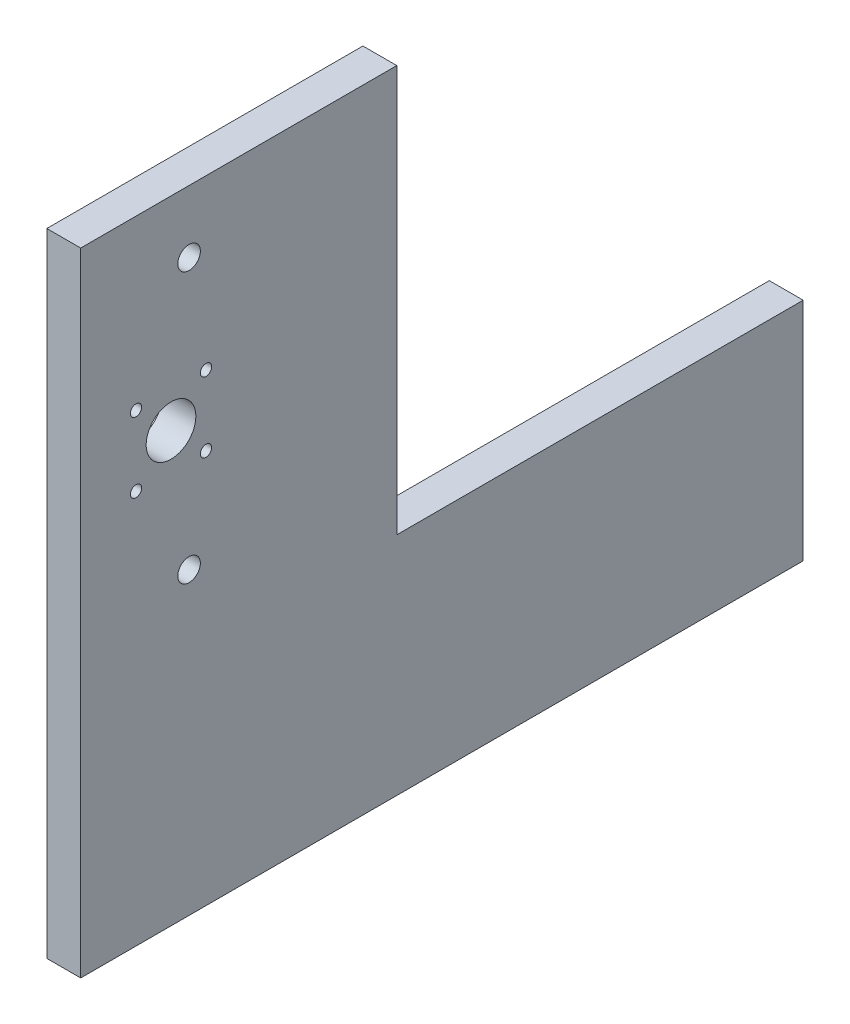
ISO-10303-21;
HEADER;
FILE_DESCRIPTION(('STEP AP214'),'2;1');
FILE_NAME('part.step','',(''),(''),'','','');
FILE_SCHEMA(('AUTOMOTIVE_DESIGN { 1 0 10303 214 1 1 1 1 }'));
ENDSEC;
DATA;
#1=APPLICATION_CONTEXT('core data for automotive mechanical design processes');
#2=APPLICATION_PROTOCOL_DEFINITION('international standard','automotive_design',2000,#1);
#3=PRODUCT_CONTEXT('',#1,'mechanical');
#4=PRODUCT('Part','Part','',(#3));
#5=PRODUCT_RELATED_PRODUCT_CATEGORY('part','',(#4));
#6=PRODUCT_DEFINITION_FORMATION('','',#4);
#7=PRODUCT_DEFINITION_CONTEXT('part definition',#1,'design');
#8=PRODUCT_DEFINITION('design','',#6,#7);
#9=PRODUCT_DEFINITION_SHAPE('','',#8);
#10=(LENGTH_UNIT() NAMED_UNIT(*) SI_UNIT(.MILLI.,.METRE.));
#11=(NAMED_UNIT(*) PLANE_ANGLE_UNIT() SI_UNIT($,.RADIAN.));
#12=(NAMED_UNIT(*) SI_UNIT($,.STERADIAN.) SOLID_ANGLE_UNIT());
#13=UNCERTAINTY_MEASURE_WITH_UNIT(LENGTH_MEASURE(1.E-05),#10,'distance_accuracy_value','');
#14=(GEOMETRIC_REPRESENTATION_CONTEXT(3) GLOBAL_UNCERTAINTY_ASSIGNED_CONTEXT((#13)) GLOBAL_UNIT_ASSIGNED_CONTEXT((#10,
#11,#12)) REPRESENTATION_CONTEXT('',''));
#15=CARTESIAN_POINT('',(0.,0.,0.));
#16=DIRECTION('',(0.,0.,1.));
#17=DIRECTION('',(1.,0.,0.));
#18=AXIS2_PLACEMENT_3D('',#15,#16,#17);
#19=CARTESIAN_POINT('',(15.,0.,0.));
#20=DIRECTION('',(-1.,0.,0.));
#21=DIRECTION('',(0.,0.,1.));
#22=AXIS2_PLACEMENT_3D('',#19,#20,#21);
#23=PLANE('',#22);
#24=DIRECTION('',(0.,0.,-1.));
#25=VECTOR('',#24,1.);
#26=CARTESIAN_POINT('',(15.,-90.6071599180089,-335.128781153256));
#27=LINE('',#26,#25);
#28=CARTESIAN_POINT('',(15.,-90.6071599180089,-15.128781153256));
#29=VERTEX_POINT('',#28);
#30=CARTESIAN_POINT('',(15.,-90.6071599180089,-335.128781153256));
#31=VERTEX_POINT('',#30);
#32=EDGE_CURVE('E128',#29,#31,#27,.T.);
#33=ORIENTED_EDGE('',*,*,#32,.T.);
#34=DIRECTION('',(0.,1.,0.));
#35=VECTOR('',#34,1.);
#36=CARTESIAN_POINT('',(15.,9.39284008199115,-335.128781153256));
#37=LINE('',#36,#35);
#38=CARTESIAN_POINT('',(15.,9.39284008199115,-335.128781153256));
#39=VERTEX_POINT('',#38);
#40=EDGE_CURVE('E86',#31,#39,#37,.T.);
#41=ORIENTED_EDGE('',*,*,#40,.T.);
#42=DIRECTION('',(0.,0.,1.));
#43=VECTOR('',#42,1.);
#44=CARTESIAN_POINT('',(15.,9.39284008199115,-155.128781153256));
#45=LINE('',#44,#43);
#46=CARTESIAN_POINT('',(15.,9.39284008199115,-155.128781153256));
#47=VERTEX_POINT('',#46);
#48=EDGE_CURVE('E99',#39,#47,#45,.T.);
#49=ORIENTED_EDGE('',*,*,#48,.T.);
#50=DIRECTION('',(0.,1.,0.));
#51=VECTOR('',#50,1.);
#52=CARTESIAN_POINT('',(15.,189.392840081991,-155.128781153256));
#53=LINE('',#52,#51);
#54=CARTESIAN_POINT('',(15.,189.392840081991,-155.128781153256));
#55=VERTEX_POINT('',#54);
#56=EDGE_CURVE('E93',#47,#55,#53,.T.);
#57=ORIENTED_EDGE('',*,*,#56,.T.);
#58=DIRECTION('',(0.,0.,1.));
#59=VECTOR('',#58,1.);
#60=CARTESIAN_POINT('',(15.,189.392840081991,-15.128781153256));
#61=LINE('',#60,#59);
#62=CARTESIAN_POINT('',(15.,189.392840081991,-15.128781153256));
#63=VERTEX_POINT('',#62);
#64=EDGE_CURVE('E97',#55,#63,#61,.T.);
#65=ORIENTED_EDGE('',*,*,#64,.T.);
#66=DIRECTION('',(0.,-1.,0.));
#67=VECTOR('',#66,1.);
#68=CARTESIAN_POINT('',(15.,-90.6071599180089,-15.128781153256));
#69=LINE('',#68,#67);
#70=EDGE_CURVE('E49',#63,#29,#69,.T.);
#71=ORIENTED_EDGE('',*,*,#70,.T.);
#72=EDGE_LOOP('',(#33,#41,#49,#57,#65,#71));
#73=FACE_BOUND('',#72,.T.);
#74=CARTESIAN_POINT('',(15.,99.3928400819911,-55.128781153256));
#75=DIRECTION('',(1.,0.,0.));
#76=DIRECTION('',(0.,0.,-1.));
#77=AXIS2_PLACEMENT_3D('',#74,#75,#76);
#78=CIRCLE('',#77,11.0000000000047);
#79=CARTESIAN_POINT('',(15.,99.3928400819911,-66.1287811532606));
#80=VERTEX_POINT('',#79);
#81=EDGE_CURVE('E121',#80,#80,#78,.T.);
#82=ORIENTED_EDGE('',*,*,#81,.F.);
#83=EDGE_LOOP('',(#82));
#84=FACE_BOUND('',#83,.T.);
#85=CARTESIAN_POINT('',(15.,114.892840081991,-39.628781153256));
#86=DIRECTION('',(1.,0.,0.));
#87=DIRECTION('',(0.,0.,-1.));
#88=AXIS2_PLACEMENT_3D('',#85,#86,#87);
#89=CIRCLE('',#88,2.50000000000467);
#90=CARTESIAN_POINT('',(15.,114.892840081991,-42.1287811532607));
#91=VERTEX_POINT('',#90);
#92=EDGE_CURVE('E222',#91,#91,#89,.T.);
#93=ORIENTED_EDGE('',*,*,#92,.F.);
#94=EDGE_LOOP('',(#93));
#95=FACE_BOUND('',#94,.T.);
#96=CARTESIAN_POINT('',(15.,161.769316482829,-63.1287811532541));
#97=DIRECTION('',(1.,0.,0.));
#98=DIRECTION('',(0.,0.,-1.));
#99=AXIS2_PLACEMENT_3D('',#96,#97,#98);
#100=CIRCLE('',#99,5.00000000000476);
#101=CARTESIAN_POINT('',(15.,161.769316482829,-68.1287811532588));
#102=VERTEX_POINT('',#101);
#103=EDGE_CURVE('E216',#102,#102,#100,.T.);
#104=ORIENTED_EDGE('',*,*,#103,.F.);
#105=EDGE_LOOP('',(#104));
#106=FACE_BOUND('',#105,.T.);
#107=CARTESIAN_POINT('',(15.,114.892840081991,-70.6287811532642));
#108=DIRECTION('',(1.,0.,0.));
#109=DIRECTION('',(0.,0.,-1.));
#110=AXIS2_PLACEMENT_3D('',#107,#108,#109);
#111=CIRCLE('',#110,2.49999999999869);
#112=CARTESIAN_POINT('',(15.,114.892840081991,-73.1287811532628));
#113=VERTEX_POINT('',#112);
#114=EDGE_CURVE('E210',#113,#113,#111,.T.);
#115=ORIENTED_EDGE('',*,*,#114,.F.);
#116=EDGE_LOOP('',(#115));
#117=FACE_BOUND('',#116,.T.);
#118=CARTESIAN_POINT('',(15.,83.8928400819862,-70.6287811532629));
#119=DIRECTION('',(1.,0.,0.));
#120=DIRECTION('',(0.,0.,-1.));
#121=AXIS2_PLACEMENT_3D('',#118,#119,#120);
#122=CIRCLE('',#121,2.50000000000009);
#123=CARTESIAN_POINT('',(15.,83.8928400819862,-73.128781153263));
#124=VERTEX_POINT('',#123);
#125=EDGE_CURVE('E204',#124,#124,#122,.T.);
#126=ORIENTED_EDGE('',*,*,#125,.F.);
#127=EDGE_LOOP('',(#126));
#128=FACE_BOUND('',#127,.T.);
#129=CARTESIAN_POINT('',(15.,83.8928400819829,-39.628781153256));
#130=DIRECTION('',(1.,0.,0.));
#131=DIRECTION('',(0.,0.,-1.));
#132=AXIS2_PLACEMENT_3D('',#129,#130,#131);
#133=CIRCLE('',#132,2.50000000000646);
#134=CARTESIAN_POINT('',(15.,83.8928400819829,-42.1287811532625));
#135=VERTEX_POINT('',#134);
#136=EDGE_CURVE('E198',#135,#135,#133,.T.);
#137=ORIENTED_EDGE('',*,*,#136,.F.);
#138=EDGE_LOOP('',(#137));
#139=FACE_BOUND('',#138,.T.);
#140=CARTESIAN_POINT('',(15.,42.0419507226647,-63.128781153256));
#141=DIRECTION('',(1.,0.,0.));
#142=DIRECTION('',(0.,0.,-1.));
#143=AXIS2_PLACEMENT_3D('',#140,#141,#142);
#144=CIRCLE('',#143,5.0000000000047);
#145=CARTESIAN_POINT('',(15.,42.0419507226647,-68.1287811532607));
#146=VERTEX_POINT('',#145);
#147=EDGE_CURVE('E189',#146,#146,#144,.T.);
#148=ORIENTED_EDGE('',*,*,#147,.F.);
#149=EDGE_LOOP('',(#148));
#150=FACE_BOUND('',#149,.T.);
#151=ADVANCED_FACE('F32',(#73,#84,#95,#106,#117,#128,#139,#150),#23,.F.);
#152=CARTESIAN_POINT('',(0.,0.,0.));
#153=DIRECTION('',(-1.,0.,0.));
#154=DIRECTION('',(0.,0.,1.));
#155=AXIS2_PLACEMENT_3D('',#152,#153,#154);
#156=PLANE('',#155);
#157=CARTESIAN_POINT('',(0.,83.8928400819829,-39.628781153256));
#158=DIRECTION('',(1.,0.,0.));
#159=DIRECTION('',(0.,0.,-1.));
#160=AXIS2_PLACEMENT_3D('',#157,#158,#159);
#161=CIRCLE('',#160,2.50000000000646);
#162=CARTESIAN_POINT('',(0.,83.8928400819829,-42.1287811532625));
#163=VERTEX_POINT('',#162);
#164=EDGE_CURVE('E195',#163,#163,#161,.T.);
#165=ORIENTED_EDGE('',*,*,#164,.T.);
#166=EDGE_LOOP('',(#165));
#167=FACE_BOUND('',#166,.T.);
#168=CARTESIAN_POINT('',(0.,114.892840081991,-70.6287811532642));
#169=DIRECTION('',(1.,0.,0.));
#170=DIRECTION('',(0.,0.,-1.));
#171=AXIS2_PLACEMENT_3D('',#168,#169,#170);
#172=CIRCLE('',#171,2.49999999999869);
#173=CARTESIAN_POINT('',(0.,114.892840081991,-73.1287811532628));
#174=VERTEX_POINT('',#173);
#175=EDGE_CURVE('E207',#174,#174,#172,.T.);
#176=ORIENTED_EDGE('',*,*,#175,.T.);
#177=EDGE_LOOP('',(#176));
#178=FACE_BOUND('',#177,.T.);
#179=CARTESIAN_POINT('',(0.,114.892840081991,-39.628781153256));
#180=DIRECTION('',(1.,0.,0.));
#181=DIRECTION('',(0.,0.,-1.));
#182=AXIS2_PLACEMENT_3D('',#179,#180,#181);
#183=CIRCLE('',#182,2.50000000000467);
#184=CARTESIAN_POINT('',(0.,114.892840081991,-42.1287811532607));
#185=VERTEX_POINT('',#184);
#186=EDGE_CURVE('E219',#185,#185,#183,.T.);
#187=ORIENTED_EDGE('',*,*,#186,.T.);
#188=EDGE_LOOP('',(#187));
#189=FACE_BOUND('',#188,.T.);
#190=DIRECTION('',(0.,0.,-1.));
#191=VECTOR('',#190,1.);
#192=CARTESIAN_POINT('',(0.,-90.6071599180089,-335.128781153256));
#193=LINE('',#192,#191);
#194=CARTESIAN_POINT('',(0.,-90.6071599180089,-15.128781153256));
#195=VERTEX_POINT('',#194);
#196=CARTESIAN_POINT('',(0.,-90.6071599180089,-335.128781153256));
#197=VERTEX_POINT('',#196);
#198=EDGE_CURVE('E117',#195,#197,#193,.T.);
#199=ORIENTED_EDGE('',*,*,#198,.F.);
#200=DIRECTION('',(0.,-1.,0.));
#201=VECTOR('',#200,1.);
#202=CARTESIAN_POINT('',(0.,-90.6071599180089,-15.128781153256));
#203=LINE('',#202,#201);
#204=CARTESIAN_POINT('',(0.,189.392840081991,-15.128781153256));
#205=VERTEX_POINT('',#204);
#206=EDGE_CURVE('E78',#205,#195,#203,.T.);
#207=ORIENTED_EDGE('',*,*,#206,.F.);
#208=DIRECTION('',(0.,0.,1.));
#209=VECTOR('',#208,1.);
#210=CARTESIAN_POINT('',(0.,189.392840081991,-15.128781153256));
#211=LINE('',#210,#209);
#212=CARTESIAN_POINT('',(0.,189.392840081991,-155.128781153256));
#213=VERTEX_POINT('',#212);
#214=EDGE_CURVE('E72',#213,#205,#211,.T.);
#215=ORIENTED_EDGE('',*,*,#214,.F.);
#216=DIRECTION('',(0.,1.,0.));
#217=VECTOR('',#216,1.);
#218=CARTESIAN_POINT('',(0.,189.392840081991,-155.128781153256));
#219=LINE('',#218,#217);
#220=CARTESIAN_POINT('',(0.,9.39284008199115,-155.128781153256));
#221=VERTEX_POINT('',#220);
#222=EDGE_CURVE('E107',#221,#213,#219,.T.);
#223=ORIENTED_EDGE('',*,*,#222,.F.);
#224=DIRECTION('',(0.,0.,1.));
#225=VECTOR('',#224,1.);
#226=CARTESIAN_POINT('',(0.,9.39284008199115,-155.128781153256));
#227=LINE('',#226,#225);
#228=CARTESIAN_POINT('',(0.,9.39284008199115,-335.128781153256));
#229=VERTEX_POINT('',#228);
#230=EDGE_CURVE('E123',#229,#221,#227,.T.);
#231=ORIENTED_EDGE('',*,*,#230,.F.);
#232=DIRECTION('',(0.,1.,0.));
#233=VECTOR('',#232,1.);
#234=CARTESIAN_POINT('',(0.,9.39284008199115,-335.128781153256));
#235=LINE('',#234,#233);
#236=EDGE_CURVE('E120',#197,#229,#235,.T.);
#237=ORIENTED_EDGE('',*,*,#236,.F.);
#238=EDGE_LOOP('',(#199,#207,#215,#223,#231,#237));
#239=FACE_BOUND('',#238,.T.);
#240=CARTESIAN_POINT('',(0.,99.3928400819911,-55.128781153256));
#241=DIRECTION('',(1.,0.,0.));
#242=DIRECTION('',(0.,0.,-1.));
#243=AXIS2_PLACEMENT_3D('',#240,#241,#242);
#244=CIRCLE('',#243,11.0000000000047);
#245=CARTESIAN_POINT('',(0.,99.3928400819911,-66.1287811532606));
#246=VERTEX_POINT('',#245);
#247=EDGE_CURVE('E225',#246,#246,#244,.T.);
#248=ORIENTED_EDGE('',*,*,#247,.T.);
#249=EDGE_LOOP('',(#248));
#250=FACE_BOUND('',#249,.T.);
#251=CARTESIAN_POINT('',(0.,161.769316482829,-63.1287811532541));
#252=DIRECTION('',(1.,0.,0.));
#253=DIRECTION('',(0.,0.,-1.));
#254=AXIS2_PLACEMENT_3D('',#251,#252,#253);
#255=CIRCLE('',#254,5.00000000000476);
#256=CARTESIAN_POINT('',(0.,161.769316482829,-68.1287811532588));
#257=VERTEX_POINT('',#256);
#258=EDGE_CURVE('E213',#257,#257,#255,.T.);
#259=ORIENTED_EDGE('',*,*,#258,.T.);
#260=EDGE_LOOP('',(#259));
#261=FACE_BOUND('',#260,.T.);
#262=CARTESIAN_POINT('',(0.,83.8928400819862,-70.6287811532629));
#263=DIRECTION('',(1.,0.,0.));
#264=DIRECTION('',(0.,0.,-1.));
#265=AXIS2_PLACEMENT_3D('',#262,#263,#264);
#266=CIRCLE('',#265,2.50000000000009);
#267=CARTESIAN_POINT('',(0.,83.8928400819862,-73.128781153263));
#268=VERTEX_POINT('',#267);
#269=EDGE_CURVE('E201',#268,#268,#266,.T.);
#270=ORIENTED_EDGE('',*,*,#269,.T.);
#271=EDGE_LOOP('',(#270));
#272=FACE_BOUND('',#271,.T.);
#273=CARTESIAN_POINT('',(0.,42.0419507226647,-63.128781153256));
#274=DIRECTION('',(1.,0.,0.));
#275=DIRECTION('',(0.,0.,-1.));
#276=AXIS2_PLACEMENT_3D('',#273,#274,#275);
#277=CIRCLE('',#276,5.0000000000047);
#278=CARTESIAN_POINT('',(0.,42.0419507226647,-68.1287811532607));
#279=VERTEX_POINT('',#278);
#280=EDGE_CURVE('E192',#279,#279,#277,.T.);
#281=ORIENTED_EDGE('',*,*,#280,.T.);
#282=EDGE_LOOP('',(#281));
#283=FACE_BOUND('',#282,.T.);
#284=ADVANCED_FACE('F137',(#167,#178,#189,#239,#250,#261,#272,#283),#156,.T.);
#285=CARTESIAN_POINT('',(15.,-90.6071599180089,-335.128781153256));
#286=DIRECTION('',(0.,1.,0.));
#287=DIRECTION('',(0.,0.,1.));
#288=AXIS2_PLACEMENT_3D('',#285,#286,#287);
#289=PLANE('',#288);
#290=ORIENTED_EDGE('',*,*,#198,.T.);
#291=DIRECTION('',(-1.,0.,0.));
#292=VECTOR('',#291,1.);
#293=CARTESIAN_POINT('',(15.,-90.6071599180089,-335.128781153256));
#294=LINE('',#293,#292);
#295=EDGE_CURVE('E11',#31,#197,#294,.T.);
#296=ORIENTED_EDGE('',*,*,#295,.F.);
#297=ORIENTED_EDGE('',*,*,#32,.F.);
#298=DIRECTION('',(-1.,0.,0.));
#299=VECTOR('',#298,1.);
#300=CARTESIAN_POINT('',(15.,-90.6071599180089,-15.128781153256));
#301=LINE('',#300,#299);
#302=EDGE_CURVE('E113',#29,#195,#301,.T.);
#303=ORIENTED_EDGE('',*,*,#302,.T.);
#304=EDGE_LOOP('',(#290,#296,#297,#303));
#305=FACE_BOUND('',#304,.T.);
#306=ADVANCED_FACE('F34',(#305),#289,.F.);
#307=CARTESIAN_POINT('',(15.,9.39284008199115,-335.128781153256));
#308=DIRECTION('',(0.,0.,1.));
#309=DIRECTION('',(0.,-1.,0.));
#310=AXIS2_PLACEMENT_3D('',#307,#308,#309);
#311=PLANE('',#310);
#312=ORIENTED_EDGE('',*,*,#236,.T.);
#313=DIRECTION('',(-1.,0.,0.));
#314=VECTOR('',#313,1.);
#315=CARTESIAN_POINT('',(15.,9.39284008199115,-335.128781153256));
#316=LINE('',#315,#314);
#317=EDGE_CURVE('E41',#39,#229,#316,.T.);
#318=ORIENTED_EDGE('',*,*,#317,.F.);
#319=ORIENTED_EDGE('',*,*,#40,.F.);
#320=ORIENTED_EDGE('',*,*,#295,.T.);
#321=EDGE_LOOP('',(#312,#318,#319,#320));
#322=FACE_BOUND('',#321,.T.);
#323=ADVANCED_FACE('F312',(#322),#311,.F.);
#324=CARTESIAN_POINT('',(15.,9.39284008199115,-155.128781153256));
#325=DIRECTION('',(0.,-1.,0.));
#326=DIRECTION('',(0.,0.,-1.));
#327=AXIS2_PLACEMENT_3D('',#324,#325,#326);
#328=PLANE('',#327);
#329=ORIENTED_EDGE('',*,*,#230,.T.);
#330=DIRECTION('',(-1.,0.,0.));
#331=VECTOR('',#330,1.);
#332=CARTESIAN_POINT('',(15.,9.39284008199115,-155.128781153256));
#333=LINE('',#332,#331);
#334=EDGE_CURVE('E108',#47,#221,#333,.T.);
#335=ORIENTED_EDGE('',*,*,#334,.F.);
#336=ORIENTED_EDGE('',*,*,#48,.F.);
#337=ORIENTED_EDGE('',*,*,#317,.T.);
#338=EDGE_LOOP('',(#329,#335,#336,#337));
#339=FACE_BOUND('',#338,.T.);
#340=ADVANCED_FACE('F134',(#339),#328,.F.);
#341=CARTESIAN_POINT('',(15.,189.392840081991,-155.128781153256));
#342=DIRECTION('',(0.,0.,1.));
#343=DIRECTION('',(0.,-1.,0.));
#344=AXIS2_PLACEMENT_3D('',#341,#342,#343);
#345=PLANE('',#344);
#346=ORIENTED_EDGE('',*,*,#222,.T.);
#347=DIRECTION('',(-1.,0.,0.));
#348=VECTOR('',#347,1.);
#349=CARTESIAN_POINT('',(15.,189.392840081991,-155.128781153256));
#350=LINE('',#349,#348);
#351=EDGE_CURVE('E104',#55,#213,#350,.T.);
#352=ORIENTED_EDGE('',*,*,#351,.F.);
#353=ORIENTED_EDGE('',*,*,#56,.F.);
#354=ORIENTED_EDGE('',*,*,#334,.T.);
#355=EDGE_LOOP('',(#346,#352,#353,#354));
#356=FACE_BOUND('',#355,.T.);
#357=ADVANCED_FACE('F105',(#356),#345,.F.);
#358=CARTESIAN_POINT('',(15.,189.392840081991,-15.128781153256));
#359=DIRECTION('',(0.,-1.,0.));
#360=DIRECTION('',(0.,0.,-1.));
#361=AXIS2_PLACEMENT_3D('',#358,#359,#360);
#362=PLANE('',#361);
#363=ORIENTED_EDGE('',*,*,#214,.T.);
#364=DIRECTION('',(-1.,0.,0.));
#365=VECTOR('',#364,1.);
#366=CARTESIAN_POINT('',(15.,189.392840081991,-15.128781153256));
#367=LINE('',#366,#365);
#368=EDGE_CURVE('E109',#63,#205,#367,.T.);
#369=ORIENTED_EDGE('',*,*,#368,.F.);
#370=ORIENTED_EDGE('',*,*,#64,.F.);
#371=ORIENTED_EDGE('',*,*,#351,.T.);
#372=EDGE_LOOP('',(#363,#369,#370,#371));
#373=FACE_BOUND('',#372,.T.);
#374=ADVANCED_FACE('F111',(#373),#362,.F.);
#375=CARTESIAN_POINT('',(15.,-90.6071599180089,-15.128781153256));
#376=DIRECTION('',(0.,0.,-1.));
#377=DIRECTION('',(0.,1.,0.));
#378=AXIS2_PLACEMENT_3D('',#375,#376,#377);
#379=PLANE('',#378);
#380=ORIENTED_EDGE('',*,*,#206,.T.);
#381=ORIENTED_EDGE('',*,*,#302,.F.);
#382=ORIENTED_EDGE('',*,*,#70,.F.);
#383=ORIENTED_EDGE('',*,*,#368,.T.);
#384=EDGE_LOOP('',(#380,#381,#382,#383));
#385=FACE_BOUND('',#384,.T.);
#386=ADVANCED_FACE('F142',(#385),#379,.F.);
#387=CARTESIAN_POINT('',(15.,99.3928400819911,-55.128781153256));
#388=DIRECTION('',(-1.,0.,0.));
#389=DIRECTION('',(0.,0.,1.));
#390=AXIS2_PLACEMENT_3D('',#387,#388,#389);
#391=CYLINDRICAL_SURFACE('',#390,11.0000000000047);
#392=ORIENTED_EDGE('',*,*,#81,.T.);
#393=EDGE_LOOP('',(#392));
#394=FACE_BOUND('',#393,.T.);
#395=ORIENTED_EDGE('',*,*,#247,.F.);
#396=EDGE_LOOP('',(#395));
#397=FACE_BOUND('',#396,.T.);
#398=ADVANCED_FACE('F144',(#394,#397),#391,.F.);
#399=CARTESIAN_POINT('',(15.,114.892840081991,-39.628781153256));
#400=DIRECTION('',(-1.,0.,0.));
#401=DIRECTION('',(0.,0.,1.));
#402=AXIS2_PLACEMENT_3D('',#399,#400,#401);
#403=CYLINDRICAL_SURFACE('',#402,2.50000000000467);
#404=ORIENTED_EDGE('',*,*,#92,.T.);
#405=EDGE_LOOP('',(#404));
#406=FACE_BOUND('',#405,.T.);
#407=ORIENTED_EDGE('',*,*,#186,.F.);
#408=EDGE_LOOP('',(#407));
#409=FACE_BOUND('',#408,.T.);
#410=ADVANCED_FACE('F150',(#406,#409),#403,.F.);
#411=CARTESIAN_POINT('',(15.,161.769316482829,-63.1287811532541));
#412=DIRECTION('',(-1.,0.,0.));
#413=DIRECTION('',(0.,0.,1.));
#414=AXIS2_PLACEMENT_3D('',#411,#412,#413);
#415=CYLINDRICAL_SURFACE('',#414,5.00000000000476);
#416=ORIENTED_EDGE('',*,*,#103,.T.);
#417=EDGE_LOOP('',(#416));
#418=FACE_BOUND('',#417,.T.);
#419=ORIENTED_EDGE('',*,*,#258,.F.);
#420=EDGE_LOOP('',(#419));
#421=FACE_BOUND('',#420,.T.);
#422=ADVANCED_FACE('F164',(#418,#421),#415,.F.);
#423=CARTESIAN_POINT('',(15.,114.892840081991,-70.6287811532642));
#424=DIRECTION('',(-1.,0.,0.));
#425=DIRECTION('',(0.,0.,1.));
#426=AXIS2_PLACEMENT_3D('',#423,#424,#425);
#427=CYLINDRICAL_SURFACE('',#426,2.49999999999869);
#428=ORIENTED_EDGE('',*,*,#114,.T.);
#429=EDGE_LOOP('',(#428));
#430=FACE_BOUND('',#429,.T.);
#431=ORIENTED_EDGE('',*,*,#175,.F.);
#432=EDGE_LOOP('',(#431));
#433=FACE_BOUND('',#432,.T.);
#434=ADVANCED_FACE('F168',(#430,#433),#427,.F.);
#435=CARTESIAN_POINT('',(15.,83.8928400819862,-70.6287811532629));
#436=DIRECTION('',(-1.,0.,0.));
#437=DIRECTION('',(0.,0.,1.));
#438=AXIS2_PLACEMENT_3D('',#435,#436,#437);
#439=CYLINDRICAL_SURFACE('',#438,2.50000000000009);
#440=ORIENTED_EDGE('',*,*,#125,.T.);
#441=EDGE_LOOP('',(#440));
#442=FACE_BOUND('',#441,.T.);
#443=ORIENTED_EDGE('',*,*,#269,.F.);
#444=EDGE_LOOP('',(#443));
#445=FACE_BOUND('',#444,.T.);
#446=ADVANCED_FACE('F172',(#442,#445),#439,.F.);
#447=CARTESIAN_POINT('',(15.,83.8928400819829,-39.628781153256));
#448=DIRECTION('',(-1.,0.,0.));
#449=DIRECTION('',(0.,0.,1.));
#450=AXIS2_PLACEMENT_3D('',#447,#448,#449);
#451=CYLINDRICAL_SURFACE('',#450,2.50000000000646);
#452=ORIENTED_EDGE('',*,*,#136,.T.);
#453=EDGE_LOOP('',(#452));
#454=FACE_BOUND('',#453,.T.);
#455=ORIENTED_EDGE('',*,*,#164,.F.);
#456=EDGE_LOOP('',(#455));
#457=FACE_BOUND('',#456,.T.);
#458=ADVANCED_FACE('F176',(#454,#457),#451,.F.);
#459=CARTESIAN_POINT('',(15.,42.0419507226647,-63.128781153256));
#460=DIRECTION('',(-1.,0.,0.));
#461=DIRECTION('',(0.,0.,1.));
#462=AXIS2_PLACEMENT_3D('',#459,#460,#461);
#463=CYLINDRICAL_SURFACE('',#462,5.0000000000047);
#464=ORIENTED_EDGE('',*,*,#147,.T.);
#465=EDGE_LOOP('',(#464));
#466=FACE_BOUND('',#465,.T.);
#467=ORIENTED_EDGE('',*,*,#280,.F.);
#468=EDGE_LOOP('',(#467));
#469=FACE_BOUND('',#468,.T.);
#470=ADVANCED_FACE('F180',(#466,#469),#463,.F.);
#471=CLOSED_SHELL('',(#151,#284,#306,#323,#340,#357,#374,#386,#398,#410,#422,#434,#446,#458,#470));
#472=MANIFOLD_SOLID_BREP('B2',#471);
#473=ADVANCED_BREP_SHAPE_REPRESENTATION('',(#18,#472),#14);
#474=SHAPE_DEFINITION_REPRESENTATION(#9,#473);
ENDSEC;
END-ISO-10303-21;
